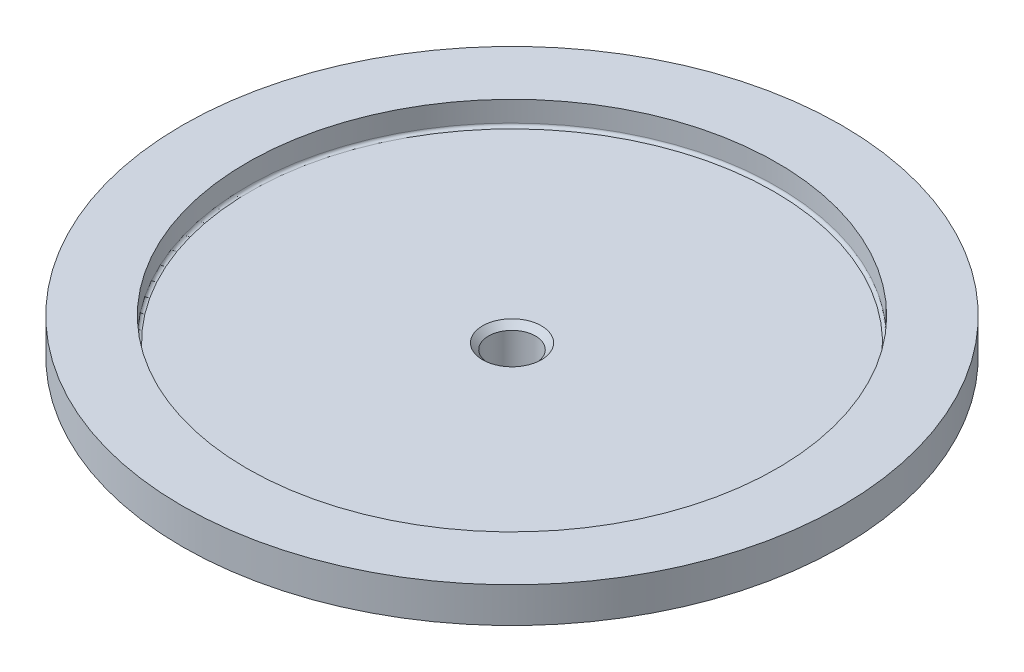
ISO-10303-21;
HEADER;
FILE_DESCRIPTION(('STEP AP214'),'2;1');
FILE_NAME('part.step','',(''),(''),'','','');
FILE_SCHEMA(('AUTOMOTIVE_DESIGN { 1 0 10303 214 1 1 1 1 }'));
ENDSEC;
DATA;
#1=APPLICATION_CONTEXT('core data for automotive mechanical design processes');
#2=APPLICATION_PROTOCOL_DEFINITION('international standard','automotive_design',2000,#1);
#3=PRODUCT_CONTEXT('',#1,'mechanical');
#4=PRODUCT('Part','Part','',(#3));
#5=PRODUCT_RELATED_PRODUCT_CATEGORY('part','',(#4));
#6=PRODUCT_DEFINITION_FORMATION('','',#4);
#7=PRODUCT_DEFINITION_CONTEXT('part definition',#1,'design');
#8=PRODUCT_DEFINITION('design','',#6,#7);
#9=PRODUCT_DEFINITION_SHAPE('','',#8);
#10=(LENGTH_UNIT() NAMED_UNIT(*) SI_UNIT(.MILLI.,.METRE.));
#11=(NAMED_UNIT(*) PLANE_ANGLE_UNIT() SI_UNIT($,.RADIAN.));
#12=(NAMED_UNIT(*) SI_UNIT($,.STERADIAN.) SOLID_ANGLE_UNIT());
#13=UNCERTAINTY_MEASURE_WITH_UNIT(LENGTH_MEASURE(1.E-05),#10,'distance_accuracy_value','');
#14=(GEOMETRIC_REPRESENTATION_CONTEXT(3) GLOBAL_UNCERTAINTY_ASSIGNED_CONTEXT((#13)) GLOBAL_UNIT_ASSIGNED_CONTEXT((#10,
#11,#12)) REPRESENTATION_CONTEXT('',''));
#15=CARTESIAN_POINT('',(0.,0.,0.));
#16=DIRECTION('',(0.,0.,1.));
#17=DIRECTION('',(1.,0.,0.));
#18=AXIS2_PLACEMENT_3D('',#15,#16,#17);
#19=CARTESIAN_POINT('',(0.,0.,0.));
#20=DIRECTION('',(0.,1.,0.));
#21=DIRECTION('',(0.,0.,1.));
#22=AXIS2_PLACEMENT_3D('',#19,#20,#21);
#23=PLANE('',#22);
#24=CARTESIAN_POINT('',(0.,0.,0.));
#25=DIRECTION('',(0.,1.,0.));
#26=DIRECTION('',(0.,0.,1.));
#27=AXIS2_PLACEMENT_3D('',#24,#25,#26);
#28=CIRCLE('',#27,10.);
#29=CARTESIAN_POINT('',(0.,0.,10.));
#30=VERTEX_POINT('',#29);
#31=EDGE_CURVE('E78',#30,#30,#28,.F.);
#32=ORIENTED_EDGE('',*,*,#31,.F.);
#33=EDGE_LOOP('',(#32));
#34=FACE_BOUND('',#33,.T.);
#35=CARTESIAN_POINT('',(0.,0.,0.));
#36=DIRECTION('',(0.,-1.,0.));
#37=DIRECTION('',(0.,0.,-1.));
#38=AXIS2_PLACEMENT_3D('',#35,#36,#37);
#39=CIRCLE('',#38,51.);
#40=CARTESIAN_POINT('',(0.,0.,-51.));
#41=VERTEX_POINT('',#40);
#42=EDGE_CURVE('E98',#41,#41,#39,.T.);
#43=ORIENTED_EDGE('',*,*,#42,.T.);
#44=EDGE_LOOP('',(#43));
#45=FACE_BOUND('',#44,.T.);
#46=ADVANCED_FACE('F32',(#34,#45),#23,.F.);
#47=CARTESIAN_POINT('',(0.,7.5,0.));
#48=DIRECTION('',(0.,-1.,0.));
#49=DIRECTION('',(0.,0.,-1.));
#50=AXIS2_PLACEMENT_3D('',#47,#48,#49);
#51=CYLINDRICAL_SURFACE('',#50,56.);
#52=CARTESIAN_POINT('',(0.,7.5,0.));
#53=DIRECTION('',(0.,1.,0.));
#54=DIRECTION('',(0.,0.,1.));
#55=AXIS2_PLACEMENT_3D('',#52,#53,#54);
#56=CIRCLE('',#55,56.);
#57=CARTESIAN_POINT('',(0.,7.5,56.));
#58=VERTEX_POINT('',#57);
#59=EDGE_CURVE('E81',#58,#58,#56,.T.);
#60=ORIENTED_EDGE('',*,*,#59,.F.);
#61=EDGE_LOOP('',(#60));
#62=FACE_BOUND('',#61,.T.);
#63=CARTESIAN_POINT('',(0.,1.5,0.));
#64=DIRECTION('',(0.,-1.,0.));
#65=DIRECTION('',(0.,0.,-1.));
#66=AXIS2_PLACEMENT_3D('',#63,#64,#65);
#67=CIRCLE('',#66,56.);
#68=CARTESIAN_POINT('',(0.,1.5,-56.));
#69=VERTEX_POINT('',#68);
#70=EDGE_CURVE('E50',#69,#69,#67,.T.);
#71=ORIENTED_EDGE('',*,*,#70,.F.);
#72=EDGE_LOOP('',(#71));
#73=FACE_BOUND('',#72,.T.);
#74=ADVANCED_FACE('F114',(#62,#73),#51,.T.);
#75=CARTESIAN_POINT('',(0.,-29.5,0.));
#76=DIRECTION('',(0.,-1.,0.));
#77=DIRECTION('',(0.,0.,-1.));
#78=AXIS2_PLACEMENT_3D('',#75,#76,#77);
#79=PLANE('',#78);
#80=CARTESIAN_POINT('',(0.,-29.5,0.));
#81=DIRECTION('',(0.,-1.,0.));
#82=DIRECTION('',(0.,0.,-1.));
#83=AXIS2_PLACEMENT_3D('',#80,#81,#82);
#84=CIRCLE('',#83,8.49999999999995);
#85=CARTESIAN_POINT('',(0.,-29.5,-8.49999999999995));
#86=VERTEX_POINT('',#85);
#87=EDGE_CURVE('E47',#86,#86,#84,.T.);
#88=ORIENTED_EDGE('',*,*,#87,.T.);
#89=EDGE_LOOP('',(#88));
#90=FACE_BOUND('',#89,.T.);
#91=CARTESIAN_POINT('',(0.,-29.5,0.));
#92=DIRECTION('',(0.,-1.,0.));
#93=DIRECTION('',(0.,0.,-1.));
#94=AXIS2_PLACEMENT_3D('',#91,#92,#93);
#95=CIRCLE('',#94,7.5);
#96=CARTESIAN_POINT('',(0.,-29.5,-7.5));
#97=VERTEX_POINT('',#96);
#98=EDGE_CURVE('E91',#97,#97,#95,.T.);
#99=ORIENTED_EDGE('',*,*,#98,.F.);
#100=EDGE_LOOP('',(#99));
#101=FACE_BOUND('',#100,.T.);
#102=ADVANCED_FACE('F116',(#90,#101),#79,.T.);
#103=CARTESIAN_POINT('',(-10.,-23.,-56.));
#104=DIRECTION('',(0.,-1.,0.));
#105=DIRECTION('',(0.,0.,-1.));
#106=AXIS2_PLACEMENT_3D('',#103,#104,#105);
#107=PLANE('',#106);
#108=CARTESIAN_POINT('',(0.,-23.,0.));
#109=DIRECTION('',(0.,-1.,0.));
#110=DIRECTION('',(0.,0.,-1.));
#111=AXIS2_PLACEMENT_3D('',#108,#109,#110);
#112=CIRCLE('',#111,10.);
#113=CARTESIAN_POINT('',(0.,-23.,-10.));
#114=VERTEX_POINT('',#113);
#115=EDGE_CURVE('E69',#114,#114,#112,.T.);
#116=ORIENTED_EDGE('',*,*,#115,.T.);
#117=EDGE_LOOP('',(#116));
#118=FACE_BOUND('',#117,.T.);
#119=CARTESIAN_POINT('',(0.,-23.,0.));
#120=DIRECTION('',(0.,-1.,0.));
#121=DIRECTION('',(0.,0.,-1.));
#122=AXIS2_PLACEMENT_3D('',#119,#120,#121);
#123=CIRCLE('',#122,7.5);
#124=CARTESIAN_POINT('',(0.,-23.,-7.5));
#125=VERTEX_POINT('',#124);
#126=EDGE_CURVE('E88',#125,#125,#123,.T.);
#127=ORIENTED_EDGE('',*,*,#126,.F.);
#128=EDGE_LOOP('',(#127));
#129=FACE_BOUND('',#128,.T.);
#130=ADVANCED_FACE('F123',(#118,#129),#107,.T.);
#131=CARTESIAN_POINT('',(0.,-35.,0.));
#132=DIRECTION('',(0.,1.,0.));
#133=DIRECTION('',(0.,0.,1.));
#134=AXIS2_PLACEMENT_3D('',#131,#132,#133);
#135=CYLINDRICAL_SURFACE('',#134,10.);
#136=ORIENTED_EDGE('',*,*,#115,.F.);
#137=EDGE_LOOP('',(#136));
#138=FACE_BOUND('',#137,.T.);
#139=ORIENTED_EDGE('',*,*,#31,.T.);
#140=EDGE_LOOP('',(#139));
#141=FACE_BOUND('',#140,.T.);
#142=ADVANCED_FACE('F178',(#138,#141),#135,.T.);
#143=CARTESIAN_POINT('',(0.,7.5,0.));
#144=DIRECTION('',(0.,1.,0.));
#145=DIRECTION('',(0.,0.,1.));
#146=AXIS2_PLACEMENT_3D('',#143,#144,#145);
#147=PLANE('',#146);
#148=CARTESIAN_POINT('',(0.,7.5,0.));
#149=DIRECTION('',(0.,1.,0.));
#150=DIRECTION('',(0.,0.,1.));
#151=AXIS2_PLACEMENT_3D('',#148,#149,#150);
#152=CIRCLE('',#151,45.);
#153=CARTESIAN_POINT('',(0.,7.5,45.));
#154=VERTEX_POINT('',#153);
#155=EDGE_CURVE('E84',#154,#154,#152,.T.);
#156=ORIENTED_EDGE('',*,*,#155,.F.);
#157=EDGE_LOOP('',(#156));
#158=FACE_BOUND('',#157,.T.);
#159=ORIENTED_EDGE('',*,*,#59,.T.);
#160=EDGE_LOOP('',(#159));
#161=FACE_BOUND('',#160,.T.);
#162=ADVANCED_FACE('F189',(#158,#161),#147,.T.);
#163=CARTESIAN_POINT('',(0.,3.5,0.));
#164=DIRECTION('',(0.,1.,0.));
#165=DIRECTION('',(0.,0.,1.));
#166=AXIS2_PLACEMENT_3D('',#163,#164,#165);
#167=CYLINDRICAL_SURFACE('',#166,45.);
#168=CARTESIAN_POINT('',(0.,4.,0.));
#169=DIRECTION('',(0.,1.,0.));
#170=DIRECTION('',(0.,0.,1.));
#171=AXIS2_PLACEMENT_3D('',#168,#169,#170);
#172=CIRCLE('',#171,45.);
#173=CARTESIAN_POINT('',(0.,4.,45.));
#174=VERTEX_POINT('',#173);
#175=EDGE_CURVE('E11',#174,#174,#172,.F.);
#176=ORIENTED_EDGE('',*,*,#175,.T.);
#177=EDGE_LOOP('',(#176));
#178=FACE_BOUND('',#177,.T.);
#179=ORIENTED_EDGE('',*,*,#155,.T.);
#180=EDGE_LOOP('',(#179));
#181=FACE_BOUND('',#180,.T.);
#182=ADVANCED_FACE('F186',(#178,#181),#167,.F.);
#183=CARTESIAN_POINT('',(0.,3.5,0.));
#184=DIRECTION('',(0.,1.,0.));
#185=DIRECTION('',(0.,0.,1.));
#186=AXIS2_PLACEMENT_3D('',#183,#184,#185);
#187=PLANE('',#186);
#188=CARTESIAN_POINT('',(0.,3.5,0.));
#189=DIRECTION('',(0.,1.,0.));
#190=DIRECTION('',(0.,0.,1.));
#191=AXIS2_PLACEMENT_3D('',#188,#189,#190);
#192=CIRCLE('',#191,44.5);
#193=CARTESIAN_POINT('',(0.,3.5,44.5));
#194=VERTEX_POINT('',#193);
#195=EDGE_CURVE('E39',#194,#194,#192,.T.);
#196=ORIENTED_EDGE('',*,*,#195,.T.);
#197=EDGE_LOOP('',(#196));
#198=FACE_BOUND('',#197,.T.);
#199=CARTESIAN_POINT('',(0.,3.5,0.));
#200=DIRECTION('',(0.,1.,0.));
#201=DIRECTION('',(0.,0.,1.));
#202=AXIS2_PLACEMENT_3D('',#199,#200,#201);
#203=CIRCLE('',#202,5.00000000000003);
#204=CARTESIAN_POINT('',(0.,3.5,5.00000000000003));
#205=VERTEX_POINT('',#204);
#206=EDGE_CURVE('E72',#205,#205,#203,.F.);
#207=ORIENTED_EDGE('',*,*,#206,.T.);
#208=EDGE_LOOP('',(#207));
#209=FACE_BOUND('',#208,.T.);
#210=ADVANCED_FACE('F182',(#198,#209),#187,.T.);
#211=CARTESIAN_POINT('',(0.,-35.,0.));
#212=DIRECTION('',(0.,1.,0.));
#213=DIRECTION('',(0.,0.,1.));
#214=AXIS2_PLACEMENT_3D('',#211,#212,#213);
#215=CYLINDRICAL_SURFACE('',#214,4.);
#216=CARTESIAN_POINT('',(0.,2.49999999999997,0.));
#217=DIRECTION('',(0.,1.,0.));
#218=DIRECTION('',(0.,0.,1.));
#219=AXIS2_PLACEMENT_3D('',#216,#217,#218);
#220=CIRCLE('',#219,4.);
#221=CARTESIAN_POINT('',(0.,2.49999999999997,4.));
#222=VERTEX_POINT('',#221);
#223=EDGE_CURVE('E75',#222,#222,#220,.T.);
#224=ORIENTED_EDGE('',*,*,#223,.T.);
#225=EDGE_LOOP('',(#224));
#226=FACE_BOUND('',#225,.T.);
#227=CARTESIAN_POINT('',(0.,-32.5,0.));
#228=DIRECTION('',(0.,1.,0.));
#229=DIRECTION('',(0.,0.,1.));
#230=AXIS2_PLACEMENT_3D('',#227,#228,#229);
#231=CIRCLE('',#230,4.);
#232=CARTESIAN_POINT('',(0.,-32.5,4.));
#233=VERTEX_POINT('',#232);
#234=EDGE_CURVE('E52',#233,#233,#231,.T.);
#235=ORIENTED_EDGE('',*,*,#234,.F.);
#236=EDGE_LOOP('',(#235));
#237=FACE_BOUND('',#236,.T.);
#238=ADVANCED_FACE('F135',(#226,#237),#215,.F.);
#239=CARTESIAN_POINT('',(0.,2.49999999999997,0.));
#240=DIRECTION('',(0.,1.,0.));
#241=DIRECTION('',(0.,0.,1.));
#242=AXIS2_PLACEMENT_3D('',#239,#240,#241);
#243=CONICAL_SURFACE('',#242,4.,0.785398163397447);
#244=ORIENTED_EDGE('',*,*,#206,.F.);
#245=EDGE_LOOP('',(#244));
#246=FACE_BOUND('',#245,.T.);
#247=ORIENTED_EDGE('',*,*,#223,.F.);
#248=EDGE_LOOP('',(#247));
#249=FACE_BOUND('',#248,.T.);
#250=ADVANCED_FACE('F131',(#246,#249),#243,.F.);
#251=CARTESIAN_POINT('',(0.,-24.5,0.));
#252=DIRECTION('',(0.,1.,0.));
#253=DIRECTION('',(0.,0.,1.));
#254=AXIS2_PLACEMENT_3D('',#251,#252,#253);
#255=CYLINDRICAL_SURFACE('',#254,7.5);
#256=CARTESIAN_POINT('',(0.,-24.5,0.));
#257=DIRECTION('',(0.,-1.,0.));
#258=DIRECTION('',(0.,0.,-1.));
#259=AXIS2_PLACEMENT_3D('',#256,#257,#258);
#260=CIRCLE('',#259,7.5);
#261=CARTESIAN_POINT('',(0.,-24.5,-7.5));
#262=VERTEX_POINT('',#261);
#263=EDGE_CURVE('E87',#262,#262,#260,.T.);
#264=ORIENTED_EDGE('',*,*,#263,.F.);
#265=EDGE_LOOP('',(#264));
#266=FACE_BOUND('',#265,.T.);
#267=ORIENTED_EDGE('',*,*,#126,.T.);
#268=EDGE_LOOP('',(#267));
#269=FACE_BOUND('',#268,.T.);
#270=ADVANCED_FACE('F134',(#266,#269),#255,.T.);
#271=CARTESIAN_POINT('',(0.,-24.5,0.));
#272=DIRECTION('',(0.,-1.,0.));
#273=DIRECTION('',(0.,0.,-1.));
#274=AXIS2_PLACEMENT_3D('',#271,#272,#273);
#275=PLANE('',#274);
#276=CARTESIAN_POINT('',(0.,-24.5,0.));
#277=DIRECTION('',(0.,-1.,0.));
#278=DIRECTION('',(0.,0.,-1.));
#279=AXIS2_PLACEMENT_3D('',#276,#277,#278);
#280=CIRCLE('',#279,8.49999999999998);
#281=CARTESIAN_POINT('',(0.,-24.5,-8.49999999999998));
#282=VERTEX_POINT('',#281);
#283=EDGE_CURVE('E57',#282,#282,#280,.F.);
#284=ORIENTED_EDGE('',*,*,#283,.T.);
#285=EDGE_LOOP('',(#284));
#286=FACE_BOUND('',#285,.T.);
#287=ORIENTED_EDGE('',*,*,#263,.T.);
#288=EDGE_LOOP('',(#287));
#289=FACE_BOUND('',#288,.T.);
#290=ADVANCED_FACE('F166',(#286,#289),#275,.F.);
#291=CARTESIAN_POINT('',(0.,-29.5,0.));
#292=DIRECTION('',(0.,1.,0.));
#293=DIRECTION('',(0.,0.,1.));
#294=AXIS2_PLACEMENT_3D('',#291,#292,#293);
#295=CYLINDRICAL_SURFACE('',#294,10.);
#296=CARTESIAN_POINT('',(0.,-28.,0.));
#297=DIRECTION('',(0.,-1.,0.));
#298=DIRECTION('',(0.,0.,-1.));
#299=AXIS2_PLACEMENT_3D('',#296,#297,#298);
#300=CIRCLE('',#299,10.);
#301=CARTESIAN_POINT('',(0.,-28.,-10.));
#302=VERTEX_POINT('',#301);
#303=EDGE_CURVE('E43',#302,#302,#300,.F.);
#304=ORIENTED_EDGE('',*,*,#303,.T.);
#305=EDGE_LOOP('',(#304));
#306=FACE_BOUND('',#305,.T.);
#307=CARTESIAN_POINT('',(0.,-26.,0.));
#308=DIRECTION('',(0.,-1.,0.));
#309=DIRECTION('',(0.,0.,-1.));
#310=AXIS2_PLACEMENT_3D('',#307,#308,#309);
#311=CIRCLE('',#310,10.);
#312=CARTESIAN_POINT('',(0.,-26.,-10.));
#313=VERTEX_POINT('',#312);
#314=EDGE_CURVE('E60',#313,#313,#311,.T.);
#315=ORIENTED_EDGE('',*,*,#314,.T.);
#316=EDGE_LOOP('',(#315));
#317=FACE_BOUND('',#316,.T.);
#318=ADVANCED_FACE('F157',(#306,#317),#295,.T.);
#319=CARTESIAN_POINT('',(0.,-32.5,0.));
#320=DIRECTION('',(0.,1.,0.));
#321=DIRECTION('',(0.,0.,1.));
#322=AXIS2_PLACEMENT_3D('',#319,#320,#321);
#323=CYLINDRICAL_SURFACE('',#322,7.5);
#324=CARTESIAN_POINT('',(0.,-31.,0.));
#325=DIRECTION('',(0.,-1.,0.));
#326=DIRECTION('',(0.,0.,-1.));
#327=AXIS2_PLACEMENT_3D('',#324,#325,#326);
#328=CIRCLE('',#327,7.5);
#329=CARTESIAN_POINT('',(0.,-31.,-7.5));
#330=VERTEX_POINT('',#329);
#331=EDGE_CURVE('E63',#330,#330,#328,.F.);
#332=ORIENTED_EDGE('',*,*,#331,.T.);
#333=EDGE_LOOP('',(#332));
#334=FACE_BOUND('',#333,.T.);
#335=ORIENTED_EDGE('',*,*,#98,.T.);
#336=EDGE_LOOP('',(#335));
#337=FACE_BOUND('',#336,.T.);
#338=ADVANCED_FACE('F155',(#334,#337),#323,.T.);
#339=CARTESIAN_POINT('',(0.,-32.5,0.));
#340=DIRECTION('',(0.,-1.,0.));
#341=DIRECTION('',(0.,0.,-1.));
#342=AXIS2_PLACEMENT_3D('',#339,#340,#341);
#343=PLANE('',#342);
#344=ORIENTED_EDGE('',*,*,#234,.T.);
#345=EDGE_LOOP('',(#344));
#346=FACE_BOUND('',#345,.T.);
#347=CARTESIAN_POINT('',(0.,-32.5,0.));
#348=DIRECTION('',(0.,-1.,0.));
#349=DIRECTION('',(0.,0.,-1.));
#350=AXIS2_PLACEMENT_3D('',#347,#348,#349);
#351=CIRCLE('',#350,5.99999999999999);
#352=CARTESIAN_POINT('',(0.,-32.5,-5.99999999999999));
#353=VERTEX_POINT('',#352);
#354=EDGE_CURVE('E66',#353,#353,#351,.T.);
#355=ORIENTED_EDGE('',*,*,#354,.T.);
#356=EDGE_LOOP('',(#355));
#357=FACE_BOUND('',#356,.T.);
#358=ADVANCED_FACE('F141',(#346,#357),#343,.T.);
#359=CARTESIAN_POINT('',(0.,-32.5,0.));
#360=DIRECTION('',(0.,1.,0.));
#361=DIRECTION('',(0.,0.,1.));
#362=AXIS2_PLACEMENT_3D('',#359,#360,#361);
#363=CONICAL_SURFACE('',#362,5.99999999999999,0.785398163397445);
#364=ORIENTED_EDGE('',*,*,#331,.F.);
#365=EDGE_LOOP('',(#364));
#366=FACE_BOUND('',#365,.T.);
#367=ORIENTED_EDGE('',*,*,#354,.F.);
#368=EDGE_LOOP('',(#367));
#369=FACE_BOUND('',#368,.T.);
#370=ADVANCED_FACE('F137',(#366,#369),#363,.T.);
#371=CARTESIAN_POINT('',(0.,-26.,0.));
#372=DIRECTION('',(0.,-1.,0.));
#373=DIRECTION('',(0.,0.,-1.));
#374=AXIS2_PLACEMENT_3D('',#371,#372,#373);
#375=CONICAL_SURFACE('',#374,10.,0.785398163397448);
#376=ORIENTED_EDGE('',*,*,#283,.F.);
#377=EDGE_LOOP('',(#376));
#378=FACE_BOUND('',#377,.T.);
#379=ORIENTED_EDGE('',*,*,#314,.F.);
#380=EDGE_LOOP('',(#379));
#381=FACE_BOUND('',#380,.T.);
#382=ADVANCED_FACE('F140',(#378,#381),#375,.T.);
#383=CARTESIAN_POINT('',(0.,-29.5,0.));
#384=DIRECTION('',(0.,1.,0.));
#385=DIRECTION('',(0.,0.,1.));
#386=AXIS2_PLACEMENT_3D('',#383,#384,#385);
#387=CONICAL_SURFACE('',#386,8.49999999999995,0.785398163397447);
#388=ORIENTED_EDGE('',*,*,#303,.F.);
#389=EDGE_LOOP('',(#388));
#390=FACE_BOUND('',#389,.T.);
#391=ORIENTED_EDGE('',*,*,#87,.F.);
#392=EDGE_LOOP('',(#391));
#393=FACE_BOUND('',#392,.T.);
#394=ADVANCED_FACE('F110',(#390,#393),#387,.T.);
#395=CARTESIAN_POINT('',(0.,1.5,0.));
#396=DIRECTION('',(0.,-1.,0.));
#397=DIRECTION('',(0.,0.,-1.));
#398=AXIS2_PLACEMENT_3D('',#395,#396,#397);
#399=PLANE('',#398);
#400=CARTESIAN_POINT('',(0.,1.5,0.));
#401=DIRECTION('',(0.,-1.,0.));
#402=DIRECTION('',(0.,0.,-1.));
#403=AXIS2_PLACEMENT_3D('',#400,#401,#402);
#404=CIRCLE('',#403,51.);
#405=CARTESIAN_POINT('',(0.,1.5,-51.));
#406=VERTEX_POINT('',#405);
#407=EDGE_CURVE('E53',#406,#406,#404,.T.);
#408=ORIENTED_EDGE('',*,*,#407,.F.);
#409=EDGE_LOOP('',(#408));
#410=FACE_BOUND('',#409,.T.);
#411=ORIENTED_EDGE('',*,*,#70,.T.);
#412=EDGE_LOOP('',(#411));
#413=FACE_BOUND('',#412,.T.);
#414=ADVANCED_FACE('F107',(#410,#413),#399,.T.);
#415=CARTESIAN_POINT('',(0.,1.5,0.));
#416=DIRECTION('',(0.,-1.,0.));
#417=DIRECTION('',(0.,0.,-1.));
#418=AXIS2_PLACEMENT_3D('',#415,#416,#417);
#419=CYLINDRICAL_SURFACE('',#418,51.);
#420=ORIENTED_EDGE('',*,*,#407,.T.);
#421=EDGE_LOOP('',(#420));
#422=FACE_BOUND('',#421,.T.);
#423=ORIENTED_EDGE('',*,*,#42,.F.);
#424=EDGE_LOOP('',(#423));
#425=FACE_BOUND('',#424,.T.);
#426=ADVANCED_FACE('F104',(#422,#425),#419,.T.);
#427=CARTESIAN_POINT('',(0.,4.,0.));
#428=DIRECTION('',(0.,1.,0.));
#429=DIRECTION('',(0.,0.,1.));
#430=AXIS2_PLACEMENT_3D('',#427,#428,#429);
#431=TOROIDAL_SURFACE('',#430,44.5,0.5);
#432=ORIENTED_EDGE('',*,*,#175,.F.);
#433=EDGE_LOOP('',(#432));
#434=FACE_BOUND('',#433,.T.);
#435=ORIENTED_EDGE('',*,*,#195,.F.);
#436=EDGE_LOOP('',(#435));
#437=FACE_BOUND('',#436,.T.);
#438=ADVANCED_FACE('F34',(#434,#437),#431,.F.);
#439=CLOSED_SHELL('',(#46,#74,#102,#130,#142,#162,#182,#210,#238,#250,#270,#290,#318,#338,#358,
#370,#382,#394,#414,#426,#438));
#440=MANIFOLD_SOLID_BREP('B2',#439);
#441=ADVANCED_BREP_SHAPE_REPRESENTATION('',(#18,#440),#14);
#442=SHAPE_DEFINITION_REPRESENTATION(#9,#441);
ENDSEC;
END-ISO-10303-21;
